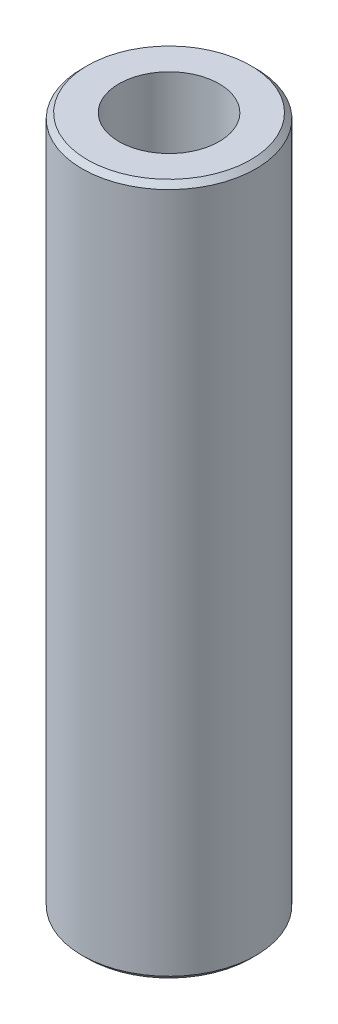
ISO-10303-21;
HEADER;
FILE_DESCRIPTION(('STEP AP214'),'2;1');
FILE_NAME('part.step','',(''),(''),'','','');
FILE_SCHEMA(('AUTOMOTIVE_DESIGN { 1 0 10303 214 1 1 1 1 }'));
ENDSEC;
DATA;
#1=APPLICATION_CONTEXT('core data for automotive mechanical design processes');
#2=APPLICATION_PROTOCOL_DEFINITION('international standard','automotive_design',2000,#1);
#3=PRODUCT_CONTEXT('',#1,'mechanical');
#4=PRODUCT('Part','Part','',(#3));
#5=PRODUCT_RELATED_PRODUCT_CATEGORY('part','',(#4));
#6=PRODUCT_DEFINITION_FORMATION('','',#4);
#7=PRODUCT_DEFINITION_CONTEXT('part definition',#1,'design');
#8=PRODUCT_DEFINITION('design','',#6,#7);
#9=PRODUCT_DEFINITION_SHAPE('','',#8);
#10=(LENGTH_UNIT() NAMED_UNIT(*) SI_UNIT(.MILLI.,.METRE.));
#11=(NAMED_UNIT(*) PLANE_ANGLE_UNIT() SI_UNIT($,.RADIAN.));
#12=(NAMED_UNIT(*) SI_UNIT($,.STERADIAN.) SOLID_ANGLE_UNIT());
#13=UNCERTAINTY_MEASURE_WITH_UNIT(LENGTH_MEASURE(1.E-05),#10,'distance_accuracy_value','');
#14=(GEOMETRIC_REPRESENTATION_CONTEXT(3) GLOBAL_UNCERTAINTY_ASSIGNED_CONTEXT((#13)) GLOBAL_UNIT_ASSIGNED_CONTEXT((#10,
#11,#12)) REPRESENTATION_CONTEXT('',''));
#15=CARTESIAN_POINT('',(0.,0.,0.));
#16=DIRECTION('',(0.,0.,1.));
#17=DIRECTION('',(1.,0.,0.));
#18=AXIS2_PLACEMENT_3D('',#15,#16,#17);
#19=CARTESIAN_POINT('',(0.,278.674665532463,0.));
#20=DIRECTION('',(0.,-1.,0.));
#21=DIRECTION('',(0.,0.,-1.));
#22=AXIS2_PLACEMENT_3D('',#19,#20,#21);
#23=CYLINDRICAL_SURFACE('',#22,35.);
#24=CARTESIAN_POINT('',(0.,276.573153146592,0.));
#25=DIRECTION('',(0.,1.,0.));
#26=DIRECTION('',(0.,0.,1.));
#27=AXIS2_PLACEMENT_3D('',#24,#25,#26);
#28=CIRCLE('',#27,35.);
#29=CARTESIAN_POINT('',(0.,276.573153146592,35.));
#30=VERTEX_POINT('',#29);
#31=EDGE_CURVE('E50',#30,#30,#28,.F.);
#32=ORIENTED_EDGE('',*,*,#31,.T.);
#33=EDGE_LOOP('',(#32));
#34=FACE_BOUND('',#33,.T.);
#35=CARTESIAN_POINT('',(0.,2.1015123858707,0.));
#36=DIRECTION('',(0.,1.,0.));
#37=DIRECTION('',(0.,0.,1.));
#38=AXIS2_PLACEMENT_3D('',#35,#36,#37);
#39=CIRCLE('',#38,35.);
#40=CARTESIAN_POINT('',(0.,2.1015123858707,35.));
#41=VERTEX_POINT('',#40);
#42=EDGE_CURVE('E51',#41,#41,#39,.T.);
#43=ORIENTED_EDGE('',*,*,#42,.T.);
#44=EDGE_LOOP('',(#43));
#45=FACE_BOUND('',#44,.T.);
#46=ADVANCED_FACE('F39',(#34,#45),#23,.T.);
#47=CARTESIAN_POINT('',(0.,278.674665532463,0.));
#48=DIRECTION('',(0.,1.,0.));
#49=DIRECTION('',(0.,0.,1.));
#50=AXIS2_PLACEMENT_3D('',#47,#48,#49);
#51=PLANE('',#50);
#52=CARTESIAN_POINT('',(0.,278.674665532463,0.));
#53=DIRECTION('',(0.,1.,0.));
#54=DIRECTION('',(0.,0.,1.));
#55=AXIS2_PLACEMENT_3D('',#52,#53,#54);
#56=CIRCLE('',#55,32.8984876141293);
#57=CARTESIAN_POINT('',(0.,278.674665532463,32.8984876141293));
#58=VERTEX_POINT('',#57);
#59=EDGE_CURVE('E54',#58,#58,#56,.T.);
#60=ORIENTED_EDGE('',*,*,#59,.T.);
#61=EDGE_LOOP('',(#60));
#62=FACE_BOUND('',#61,.T.);
#63=CARTESIAN_POINT('',(0.,278.674665532463,0.));
#64=DIRECTION('',(0.,1.,0.));
#65=DIRECTION('',(0.,0.,1.));
#66=AXIS2_PLACEMENT_3D('',#63,#64,#65);
#67=CIRCLE('',#66,20.1893996194209);
#68=CARTESIAN_POINT('',(0.,278.674665532463,20.1893996194209));
#69=VERTEX_POINT('',#68);
#70=EDGE_CURVE('E58',#69,#69,#67,.T.);
#71=ORIENTED_EDGE('',*,*,#70,.F.);
#72=EDGE_LOOP('',(#71));
#73=FACE_BOUND('',#72,.T.);
#74=ADVANCED_FACE('F69',(#62,#73),#51,.T.);
#75=CARTESIAN_POINT('',(0.,0.,0.));
#76=DIRECTION('',(0.,1.,0.));
#77=DIRECTION('',(0.,0.,1.));
#78=AXIS2_PLACEMENT_3D('',#75,#76,#77);
#79=PLANE('',#78);
#80=CARTESIAN_POINT('',(0.,0.,0.));
#81=DIRECTION('',(0.,1.,0.));
#82=DIRECTION('',(0.,0.,1.));
#83=AXIS2_PLACEMENT_3D('',#80,#81,#82);
#84=CIRCLE('',#83,32.8984876141293);
#85=CARTESIAN_POINT('',(0.,0.,32.8984876141293));
#86=VERTEX_POINT('',#85);
#87=EDGE_CURVE('E10',#86,#86,#84,.F.);
#88=ORIENTED_EDGE('',*,*,#87,.T.);
#89=EDGE_LOOP('',(#88));
#90=FACE_BOUND('',#89,.T.);
#91=CARTESIAN_POINT('',(0.,0.,0.));
#92=DIRECTION('',(0.,1.,0.));
#93=DIRECTION('',(0.,0.,1.));
#94=AXIS2_PLACEMENT_3D('',#91,#92,#93);
#95=CIRCLE('',#94,20.1893996194209);
#96=CARTESIAN_POINT('',(0.,0.,20.1893996194209));
#97=VERTEX_POINT('',#96);
#98=EDGE_CURVE('E63',#97,#97,#95,.T.);
#99=ORIENTED_EDGE('',*,*,#98,.T.);
#100=EDGE_LOOP('',(#99));
#101=FACE_BOUND('',#100,.T.);
#102=ADVANCED_FACE('F75',(#90,#101),#79,.F.);
#103=CARTESIAN_POINT('',(0.,278.674665532463,0.));
#104=DIRECTION('',(0.,-1.,0.));
#105=DIRECTION('',(0.,0.,-1.));
#106=AXIS2_PLACEMENT_3D('',#103,#104,#105);
#107=CYLINDRICAL_SURFACE('',#106,20.1893996194209);
#108=ORIENTED_EDGE('',*,*,#70,.T.);
#109=EDGE_LOOP('',(#108));
#110=FACE_BOUND('',#109,.T.);
#111=ORIENTED_EDGE('',*,*,#98,.F.);
#112=EDGE_LOOP('',(#111));
#113=FACE_BOUND('',#112,.T.);
#114=ADVANCED_FACE('F70',(#110,#113),#107,.F.);
#115=CARTESIAN_POINT('',(0.,278.674665532463,0.));
#116=DIRECTION('',(0.,-1.,0.));
#117=DIRECTION('',(0.,0.,-1.));
#118=AXIS2_PLACEMENT_3D('',#115,#116,#117);
#119=CONICAL_SURFACE('',#118,32.8984876141293,0.785398163397437);
#120=ORIENTED_EDGE('',*,*,#31,.F.);
#121=EDGE_LOOP('',(#120));
#122=FACE_BOUND('',#121,.T.);
#123=ORIENTED_EDGE('',*,*,#59,.F.);
#124=EDGE_LOOP('',(#123));
#125=FACE_BOUND('',#124,.T.);
#126=ADVANCED_FACE('F81',(#122,#125),#119,.T.);
#127=CARTESIAN_POINT('',(0.,2.1015123858707,0.));
#128=DIRECTION('',(0.,1.,0.));
#129=DIRECTION('',(0.,0.,1.));
#130=AXIS2_PLACEMENT_3D('',#127,#128,#129);
#131=CONICAL_SURFACE('',#130,35.,0.785398163397443);
#132=ORIENTED_EDGE('',*,*,#87,.F.);
#133=EDGE_LOOP('',(#132));
#134=FACE_BOUND('',#133,.T.);
#135=ORIENTED_EDGE('',*,*,#42,.F.);
#136=EDGE_LOOP('',(#135));
#137=FACE_BOUND('',#136,.T.);
#138=ADVANCED_FACE('F45',(#134,#137),#131,.T.);
#139=CLOSED_SHELL('',(#46,#74,#102,#114,#126,#138));
#140=MANIFOLD_SOLID_BREP('B2',#139);
#141=ADVANCED_BREP_SHAPE_REPRESENTATION('',(#18,#140),#14);
#142=SHAPE_DEFINITION_REPRESENTATION(#9,#141);
ENDSEC;
END-ISO-10303-21;
